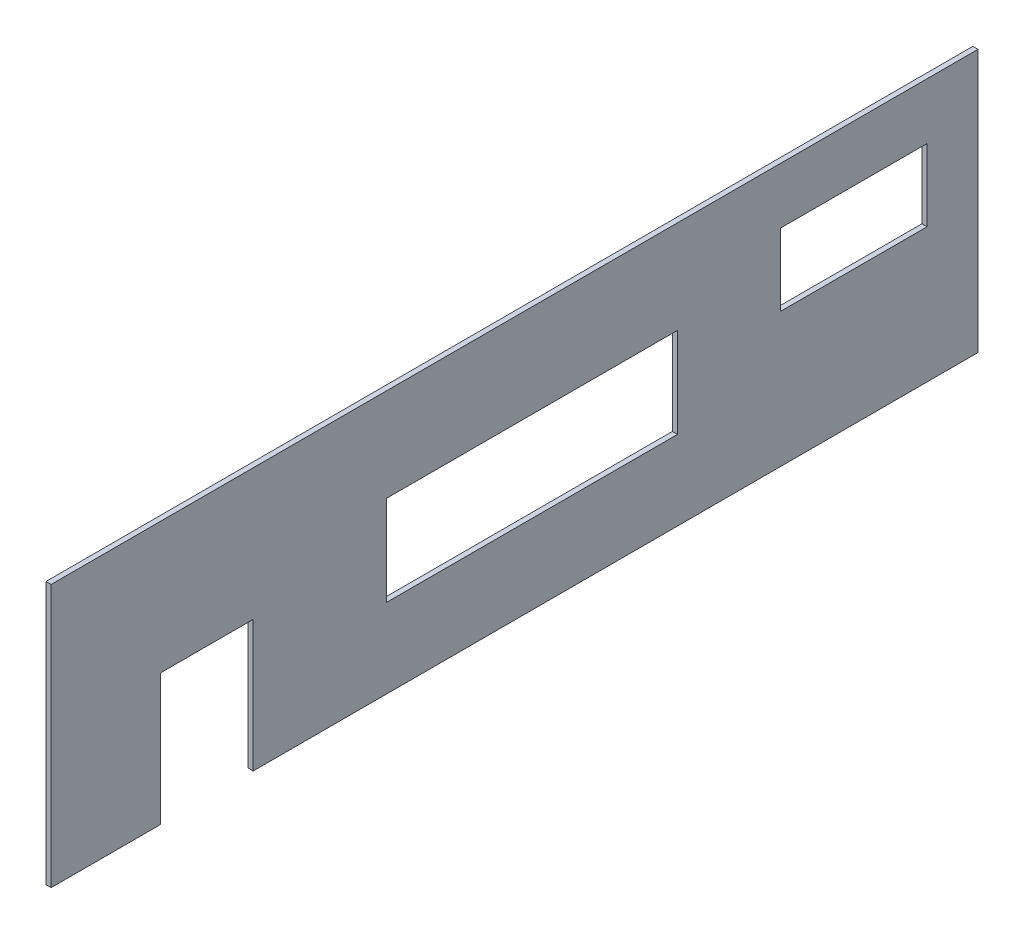
ISO-10303-21;
HEADER;
FILE_DESCRIPTION(('STEP AP214'),'2;1');
FILE_NAME('part.step','',(''),(''),'','','');
FILE_SCHEMA(('AUTOMOTIVE_DESIGN { 1 0 10303 214 1 1 1 1 }'));
ENDSEC;
DATA;
#1=APPLICATION_CONTEXT('core data for automotive mechanical design processes');
#2=APPLICATION_PROTOCOL_DEFINITION('international standard','automotive_design',2000,#1);
#3=PRODUCT_CONTEXT('',#1,'mechanical');
#4=PRODUCT('Part','Part','',(#3));
#5=PRODUCT_RELATED_PRODUCT_CATEGORY('part','',(#4));
#6=PRODUCT_DEFINITION_FORMATION('','',#4);
#7=PRODUCT_DEFINITION_CONTEXT('part definition',#1,'design');
#8=PRODUCT_DEFINITION('design','',#6,#7);
#9=PRODUCT_DEFINITION_SHAPE('','',#8);
#10=(LENGTH_UNIT() NAMED_UNIT(*) SI_UNIT(.MILLI.,.METRE.));
#11=(NAMED_UNIT(*) PLANE_ANGLE_UNIT() SI_UNIT($,.RADIAN.));
#12=(NAMED_UNIT(*) SI_UNIT($,.STERADIAN.) SOLID_ANGLE_UNIT());
#13=UNCERTAINTY_MEASURE_WITH_UNIT(LENGTH_MEASURE(1.E-05),#10,'distance_accuracy_value','');
#14=(GEOMETRIC_REPRESENTATION_CONTEXT(3) GLOBAL_UNCERTAINTY_ASSIGNED_CONTEXT((#13)) GLOBAL_UNIT_ASSIGNED_CONTEXT((#10,
#11,#12)) REPRESENTATION_CONTEXT('',''));
#15=CARTESIAN_POINT('',(0.,0.,0.));
#16=DIRECTION('',(0.,0.,1.));
#17=DIRECTION('',(1.,0.,0.));
#18=AXIS2_PLACEMENT_3D('',#15,#16,#17);
#19=CARTESIAN_POINT('',(2.,19.3043478260869,117.391304347826));
#20=DIRECTION('',(0.,1.,0.));
#21=DIRECTION('',(0.,0.,1.));
#22=AXIS2_PLACEMENT_3D('',#19,#20,#21);
#23=PLANE('',#22);
#24=DIRECTION('',(0.,0.,-1.));
#25=VECTOR('',#24,1.);
#26=CARTESIAN_POINT('',(0.,19.3043478260869,117.391304347826));
#27=LINE('',#26,#25);
#28=CARTESIAN_POINT('',(0.,19.3043478260869,117.391304347826));
#29=VERTEX_POINT('',#28);
#30=CARTESIAN_POINT('',(0.,19.3043478260869,74.9143438257151));
#31=VERTEX_POINT('',#30);
#32=EDGE_CURVE('E250',#29,#31,#27,.T.);
#33=ORIENTED_EDGE('',*,*,#32,.T.);
#34=DIRECTION('',(-1.,0.,0.));
#35=VECTOR('',#34,1.);
#36=CARTESIAN_POINT('',(10.,19.3043478260869,74.9143438257151));
#37=LINE('',#36,#35);
#38=CARTESIAN_POINT('',(2.,19.3043478260869,74.9143438257151));
#39=VERTEX_POINT('',#38);
#40=EDGE_CURVE('E191',#39,#31,#37,.T.);
#41=ORIENTED_EDGE('',*,*,#40,.F.);
#42=DIRECTION('',(0.,0.,-1.));
#43=VECTOR('',#42,1.);
#44=CARTESIAN_POINT('',(2.,19.3043478260869,117.391304347826));
#45=LINE('',#44,#43);
#46=CARTESIAN_POINT('',(2.,19.3043478260869,117.391304347826));
#47=VERTEX_POINT('',#46);
#48=EDGE_CURVE('E239',#47,#39,#45,.T.);
#49=ORIENTED_EDGE('',*,*,#48,.F.);
#50=DIRECTION('',(-1.,0.,0.));
#51=VECTOR('',#50,1.);
#52=CARTESIAN_POINT('',(2.,19.3043478260869,117.391304347826));
#53=LINE('',#52,#51);
#54=EDGE_CURVE('E11',#47,#29,#53,.T.);
#55=ORIENTED_EDGE('',*,*,#54,.T.);
#56=EDGE_LOOP('',(#33,#41,#49,#55));
#57=FACE_BOUND('',#56,.T.);
#58=ADVANCED_FACE('F33',(#57),#23,.F.);
#59=CARTESIAN_POINT('',(2.,121.304347826087,117.391304347826));
#60=DIRECTION('',(0.,0.,-1.));
#61=DIRECTION('',(0.,1.,0.));
#62=AXIS2_PLACEMENT_3D('',#59,#60,#61);
#63=PLANE('',#62);
#64=DIRECTION('',(0.,-1.,0.));
#65=VECTOR('',#64,1.);
#66=CARTESIAN_POINT('',(0.,121.304347826087,117.391304347826));
#67=LINE('',#66,#65);
#68=CARTESIAN_POINT('',(0.,121.304347826087,117.391304347826));
#69=VERTEX_POINT('',#68);
#70=EDGE_CURVE('E233',#69,#29,#67,.T.);
#71=ORIENTED_EDGE('',*,*,#70,.T.);
#72=ORIENTED_EDGE('',*,*,#54,.F.);
#73=DIRECTION('',(0.,-1.,0.));
#74=VECTOR('',#73,1.);
#75=CARTESIAN_POINT('',(2.,121.304347826087,117.391304347826));
#76=LINE('',#75,#74);
#77=CARTESIAN_POINT('',(2.,121.304347826087,117.391304347826));
#78=VERTEX_POINT('',#77);
#79=EDGE_CURVE('E234',#78,#47,#76,.T.);
#80=ORIENTED_EDGE('',*,*,#79,.F.);
#81=DIRECTION('',(-1.,0.,0.));
#82=VECTOR('',#81,1.);
#83=CARTESIAN_POINT('',(2.,121.304347826087,117.391304347826));
#84=LINE('',#83,#82);
#85=EDGE_CURVE('E246',#78,#69,#84,.T.);
#86=ORIENTED_EDGE('',*,*,#85,.T.);
#87=EDGE_LOOP('',(#71,#72,#80,#86));
#88=FACE_BOUND('',#87,.T.);
#89=ADVANCED_FACE('F35',(#88),#63,.F.);
#90=CARTESIAN_POINT('',(2.,19.3043478260869,38.9143438257151));
#91=VERTEX_POINT('',#90);
#92=CARTESIAN_POINT('',(2.,19.3043478260869,-242.608695652174));
#93=VERTEX_POINT('',#92);
#94=EDGE_CURVE('E237',#91,#93,#45,.T.);
#95=ORIENTED_EDGE('',*,*,#94,.F.);
#96=DIRECTION('',(-1.,0.,0.));
#97=VECTOR('',#96,1.);
#98=CARTESIAN_POINT('',(10.,19.3043478260869,38.9143438257151));
#99=LINE('',#98,#97);
#100=CARTESIAN_POINT('',(0.,19.3043478260869,38.9143438257151));
#101=VERTEX_POINT('',#100);
#102=EDGE_CURVE('E194',#91,#101,#99,.T.);
#103=ORIENTED_EDGE('',*,*,#102,.T.);
#104=CARTESIAN_POINT('',(0.,19.3043478260869,-242.608695652174));
#105=VERTEX_POINT('',#104);
#106=EDGE_CURVE('E249',#101,#105,#27,.T.);
#107=ORIENTED_EDGE('',*,*,#106,.T.);
#108=DIRECTION('',(-1.,0.,0.));
#109=VECTOR('',#108,1.);
#110=CARTESIAN_POINT('',(2.,19.3043478260869,-242.608695652174));
#111=LINE('',#110,#109);
#112=EDGE_CURVE('E41',#93,#105,#111,.T.);
#113=ORIENTED_EDGE('',*,*,#112,.F.);
#114=EDGE_LOOP('',(#95,#103,#107,#113));
#115=FACE_BOUND('',#114,.T.);
#116=ADVANCED_FACE('F288',(#115),#23,.F.);
#117=CARTESIAN_POINT('',(2.,121.304347826087,-242.608695652174));
#118=DIRECTION('',(0.,0.,1.));
#119=DIRECTION('',(0.,-1.,0.));
#120=AXIS2_PLACEMENT_3D('',#117,#118,#119);
#121=PLANE('',#120);
#122=DIRECTION('',(0.,1.,0.));
#123=VECTOR('',#122,1.);
#124=CARTESIAN_POINT('',(0.,121.304347826087,-242.608695652174));
#125=LINE('',#124,#123);
#126=CARTESIAN_POINT('',(0.,121.304347826087,-242.608695652174));
#127=VERTEX_POINT('',#126);
#128=EDGE_CURVE('E253',#105,#127,#125,.T.);
#129=ORIENTED_EDGE('',*,*,#128,.T.);
#130=DIRECTION('',(-1.,0.,0.));
#131=VECTOR('',#130,1.);
#132=CARTESIAN_POINT('',(2.,121.304347826087,-242.608695652174));
#133=LINE('',#132,#131);
#134=CARTESIAN_POINT('',(2.,121.304347826087,-242.608695652174));
#135=VERTEX_POINT('',#134);
#136=EDGE_CURVE('E258',#135,#127,#133,.T.);
#137=ORIENTED_EDGE('',*,*,#136,.F.);
#138=DIRECTION('',(0.,1.,0.));
#139=VECTOR('',#138,1.);
#140=CARTESIAN_POINT('',(2.,121.304347826087,-242.608695652174));
#141=LINE('',#140,#139);
#142=EDGE_CURVE('E242',#93,#135,#141,.T.);
#143=ORIENTED_EDGE('',*,*,#142,.F.);
#144=ORIENTED_EDGE('',*,*,#112,.T.);
#145=EDGE_LOOP('',(#129,#137,#143,#144));
#146=FACE_BOUND('',#145,.T.);
#147=ADVANCED_FACE('F265',(#146),#121,.F.);
#148=CARTESIAN_POINT('',(2.,121.304347826087,117.391304347826));
#149=DIRECTION('',(0.,-1.,0.));
#150=DIRECTION('',(0.,0.,-1.));
#151=AXIS2_PLACEMENT_3D('',#148,#149,#150);
#152=PLANE('',#151);
#153=DIRECTION('',(0.,0.,1.));
#154=VECTOR('',#153,1.);
#155=CARTESIAN_POINT('',(0.,121.304347826087,117.391304347826));
#156=LINE('',#155,#154);
#157=EDGE_CURVE('E238',#127,#69,#156,.T.);
#158=ORIENTED_EDGE('',*,*,#157,.T.);
#159=ORIENTED_EDGE('',*,*,#85,.F.);
#160=DIRECTION('',(0.,0.,1.));
#161=VECTOR('',#160,1.);
#162=CARTESIAN_POINT('',(2.,121.304347826087,117.391304347826));
#163=LINE('',#162,#161);
#164=EDGE_CURVE('E244',#135,#78,#163,.T.);
#165=ORIENTED_EDGE('',*,*,#164,.F.);
#166=ORIENTED_EDGE('',*,*,#136,.T.);
#167=EDGE_LOOP('',(#158,#159,#165,#166));
#168=FACE_BOUND('',#167,.T.);
#169=ADVANCED_FACE('F277',(#168),#152,.F.);
#170=CARTESIAN_POINT('',(2.,0.,0.));
#171=DIRECTION('',(1.,0.,0.));
#172=DIRECTION('',(0.,0.,-1.));
#173=AXIS2_PLACEMENT_3D('',#170,#171,#172);
#174=PLANE('',#173);
#175=DIRECTION('',(0.,1.,0.));
#176=VECTOR('',#175,1.);
#177=CARTESIAN_POINT('',(2.,0.,-222.833824882395));
#178=LINE('',#177,#176);
#179=CARTESIAN_POINT('',(2.,71.5107775658255,-222.833824882395));
#180=VERTEX_POINT('',#179);
#181=CARTESIAN_POINT('',(2.,99.5107775658255,-222.833824882395));
#182=VERTEX_POINT('',#181);
#183=EDGE_CURVE('E179',#180,#182,#178,.T.);
#184=ORIENTED_EDGE('',*,*,#183,.F.);
#185=DIRECTION('',(0.,0.,-1.));
#186=VECTOR('',#185,1.);
#187=CARTESIAN_POINT('',(2.,71.5107775658255,0.));
#188=LINE('',#187,#186);
#189=CARTESIAN_POINT('',(2.,71.5107775658255,-165.833824882395));
#190=VERTEX_POINT('',#189);
#191=EDGE_CURVE('E172',#190,#180,#188,.T.);
#192=ORIENTED_EDGE('',*,*,#191,.F.);
#193=DIRECTION('',(0.,-1.,0.));
#194=VECTOR('',#193,1.);
#195=CARTESIAN_POINT('',(2.,0.,-165.833824882395));
#196=LINE('',#195,#194);
#197=CARTESIAN_POINT('',(2.,99.5107775658255,-165.833824882395));
#198=VERTEX_POINT('',#197);
#199=EDGE_CURVE('E152',#198,#190,#196,.T.);
#200=ORIENTED_EDGE('',*,*,#199,.F.);
#201=DIRECTION('',(0.,0.,1.));
#202=VECTOR('',#201,1.);
#203=CARTESIAN_POINT('',(2.,99.5107775658255,0.));
#204=LINE('',#203,#202);
#205=EDGE_CURVE('E177',#182,#198,#204,.T.);
#206=ORIENTED_EDGE('',*,*,#205,.F.);
#207=EDGE_LOOP('',(#184,#192,#200,#206));
#208=FACE_BOUND('',#207,.T.);
#209=DIRECTION('',(0.,-1.,0.));
#210=VECTOR('',#209,1.);
#211=CARTESIAN_POINT('',(2.,0.,74.9143438257151));
#212=LINE('',#211,#210);
#213=CARTESIAN_POINT('',(2.,70.3043478260869,74.9143438257151));
#214=VERTEX_POINT('',#213);
#215=EDGE_CURVE('E231',#214,#39,#212,.T.);
#216=ORIENTED_EDGE('',*,*,#215,.F.);
#217=DIRECTION('',(0.,0.,1.));
#218=VECTOR('',#217,1.);
#219=CARTESIAN_POINT('',(2.,70.3043478260869,0.));
#220=LINE('',#219,#218);
#221=CARTESIAN_POINT('',(2.,70.3043478260869,38.9143438257151));
#222=VERTEX_POINT('',#221);
#223=EDGE_CURVE('E227',#222,#214,#220,.T.);
#224=ORIENTED_EDGE('',*,*,#223,.F.);
#225=DIRECTION('',(0.,1.,0.));
#226=VECTOR('',#225,1.);
#227=CARTESIAN_POINT('',(2.,0.,38.9143438257151));
#228=LINE('',#227,#226);
#229=EDGE_CURVE('E229',#91,#222,#228,.T.);
#230=ORIENTED_EDGE('',*,*,#229,.F.);
#231=ORIENTED_EDGE('',*,*,#94,.T.);
#232=ORIENTED_EDGE('',*,*,#142,.T.);
#233=ORIENTED_EDGE('',*,*,#164,.T.);
#234=ORIENTED_EDGE('',*,*,#79,.T.);
#235=ORIENTED_EDGE('',*,*,#48,.T.);
#236=EDGE_LOOP('',(#216,#224,#230,#231,#232,#233,#234,#235));
#237=FACE_BOUND('',#236,.T.);
#238=DIRECTION('',(0.,1.,0.));
#239=VECTOR('',#238,1.);
#240=CARTESIAN_POINT('',(2.,0.,-125.866260537104));
#241=LINE('',#240,#239);
#242=CARTESIAN_POINT('',(2.,50.1308071854282,-125.866260537104));
#243=VERTEX_POINT('',#242);
#244=CARTESIAN_POINT('',(2.,85.1308071854282,-125.866260537104));
#245=VERTEX_POINT('',#244);
#246=EDGE_CURVE('E225',#243,#245,#241,.T.);
#247=ORIENTED_EDGE('',*,*,#246,.F.);
#248=DIRECTION('',(0.,0.,-1.));
#249=VECTOR('',#248,1.);
#250=CARTESIAN_POINT('',(2.,50.1308071854282,0.));
#251=LINE('',#250,#249);
#252=CARTESIAN_POINT('',(2.,50.1308071854282,-12.8662605371042));
#253=VERTEX_POINT('',#252);
#254=EDGE_CURVE('E193',#253,#243,#251,.T.);
#255=ORIENTED_EDGE('',*,*,#254,.F.);
#256=DIRECTION('',(0.,-1.,0.));
#257=VECTOR('',#256,1.);
#258=CARTESIAN_POINT('',(2.,0.,-12.8662605371042));
#259=LINE('',#258,#257);
#260=CARTESIAN_POINT('',(2.,85.1308071854282,-12.8662605371042));
#261=VERTEX_POINT('',#260);
#262=EDGE_CURVE('E220',#261,#253,#259,.T.);
#263=ORIENTED_EDGE('',*,*,#262,.F.);
#264=DIRECTION('',(0.,0.,1.));
#265=VECTOR('',#264,1.);
#266=CARTESIAN_POINT('',(2.,85.1308071854282,0.));
#267=LINE('',#266,#265);
#268=EDGE_CURVE('E223',#245,#261,#267,.T.);
#269=ORIENTED_EDGE('',*,*,#268,.F.);
#270=EDGE_LOOP('',(#247,#255,#263,#269));
#271=FACE_BOUND('',#270,.T.);
#272=ADVANCED_FACE('F284',(#208,#237,#271),#174,.T.);
#273=CARTESIAN_POINT('',(0.,0.,0.));
#274=DIRECTION('',(1.,0.,0.));
#275=DIRECTION('',(0.,0.,-1.));
#276=AXIS2_PLACEMENT_3D('',#273,#274,#275);
#277=PLANE('',#276);
#278=DIRECTION('',(0.,0.,1.));
#279=VECTOR('',#278,1.);
#280=CARTESIAN_POINT('',(0.,71.5107775658255,-222.833824882395));
#281=LINE('',#280,#279);
#282=CARTESIAN_POINT('',(0.,71.5107775658255,-222.833824882395));
#283=VERTEX_POINT('',#282);
#284=CARTESIAN_POINT('',(0.,71.5107775658255,-165.833824882395));
#285=VERTEX_POINT('',#284);
#286=EDGE_CURVE('E158',#283,#285,#281,.T.);
#287=ORIENTED_EDGE('',*,*,#286,.F.);
#288=DIRECTION('',(0.,-1.,0.));
#289=VECTOR('',#288,1.);
#290=CARTESIAN_POINT('',(0.,99.5107775658255,-222.833824882395));
#291=LINE('',#290,#289);
#292=CARTESIAN_POINT('',(0.,99.5107775658255,-222.833824882395));
#293=VERTEX_POINT('',#292);
#294=EDGE_CURVE('E56',#293,#283,#291,.T.);
#295=ORIENTED_EDGE('',*,*,#294,.F.);
#296=DIRECTION('',(0.,0.,-1.));
#297=VECTOR('',#296,1.);
#298=CARTESIAN_POINT('',(0.,99.5107775658255,-222.833824882395));
#299=LINE('',#298,#297);
#300=CARTESIAN_POINT('',(0.,99.5107775658255,-165.833824882395));
#301=VERTEX_POINT('',#300);
#302=EDGE_CURVE('E165',#301,#293,#299,.T.);
#303=ORIENTED_EDGE('',*,*,#302,.F.);
#304=DIRECTION('',(0.,1.,0.));
#305=VECTOR('',#304,1.);
#306=CARTESIAN_POINT('',(0.,99.5107775658255,-165.833824882395));
#307=LINE('',#306,#305);
#308=EDGE_CURVE('E149',#285,#301,#307,.T.);
#309=ORIENTED_EDGE('',*,*,#308,.F.);
#310=EDGE_LOOP('',(#287,#295,#303,#309));
#311=FACE_BOUND('',#310,.T.);
#312=DIRECTION('',(0.,0.,1.));
#313=VECTOR('',#312,1.);
#314=CARTESIAN_POINT('',(0.,50.1308071854282,-125.866260537104));
#315=LINE('',#314,#313);
#316=CARTESIAN_POINT('',(0.,50.1308071854282,-125.866260537104));
#317=VERTEX_POINT('',#316);
#318=CARTESIAN_POINT('',(0.,50.1308071854282,-12.8662605371042));
#319=VERTEX_POINT('',#318);
#320=EDGE_CURVE('E202',#317,#319,#315,.T.);
#321=ORIENTED_EDGE('',*,*,#320,.F.);
#322=DIRECTION('',(0.,-1.,0.));
#323=VECTOR('',#322,1.);
#324=CARTESIAN_POINT('',(0.,85.1308071854282,-125.866260537104));
#325=LINE('',#324,#323);
#326=CARTESIAN_POINT('',(0.,85.1308071854282,-125.866260537104));
#327=VERTEX_POINT('',#326);
#328=EDGE_CURVE('E181',#327,#317,#325,.T.);
#329=ORIENTED_EDGE('',*,*,#328,.F.);
#330=DIRECTION('',(0.,0.,-1.));
#331=VECTOR('',#330,1.);
#332=CARTESIAN_POINT('',(0.,85.1308071854282,-125.866260537104));
#333=LINE('',#332,#331);
#334=CARTESIAN_POINT('',(0.,85.1308071854282,-12.8662605371042));
#335=VERTEX_POINT('',#334);
#336=EDGE_CURVE('E208',#335,#327,#333,.T.);
#337=ORIENTED_EDGE('',*,*,#336,.F.);
#338=DIRECTION('',(0.,1.,0.));
#339=VECTOR('',#338,1.);
#340=CARTESIAN_POINT('',(0.,85.1308071854282,-12.8662605371042));
#341=LINE('',#340,#339);
#342=EDGE_CURVE('E205',#319,#335,#341,.T.);
#343=ORIENTED_EDGE('',*,*,#342,.F.);
#344=EDGE_LOOP('',(#321,#329,#337,#343));
#345=FACE_BOUND('',#344,.T.);
#346=DIRECTION('',(0.,0.,-1.));
#347=VECTOR('',#346,1.);
#348=CARTESIAN_POINT('',(0.,70.3043478260869,74.9143438257151));
#349=LINE('',#348,#347);
#350=CARTESIAN_POINT('',(0.,70.3043478260869,74.9143438257151));
#351=VERTEX_POINT('',#350);
#352=CARTESIAN_POINT('',(0.,70.3043478260869,38.9143438257151));
#353=VERTEX_POINT('',#352);
#354=EDGE_CURVE('E184',#351,#353,#349,.T.);
#355=ORIENTED_EDGE('',*,*,#354,.F.);
#356=DIRECTION('',(0.,1.,0.));
#357=VECTOR('',#356,1.);
#358=CARTESIAN_POINT('',(0.,19.3043478260869,74.9143438257151));
#359=LINE('',#358,#357);
#360=EDGE_CURVE('E182',#31,#351,#359,.T.);
#361=ORIENTED_EDGE('',*,*,#360,.F.);
#362=ORIENTED_EDGE('',*,*,#32,.F.);
#363=ORIENTED_EDGE('',*,*,#70,.F.);
#364=ORIENTED_EDGE('',*,*,#157,.F.);
#365=ORIENTED_EDGE('',*,*,#128,.F.);
#366=ORIENTED_EDGE('',*,*,#106,.F.);
#367=DIRECTION('',(0.,-1.,0.));
#368=VECTOR('',#367,1.);
#369=CARTESIAN_POINT('',(0.,19.3043478260869,38.9143438257151));
#370=LINE('',#369,#368);
#371=EDGE_CURVE('E188',#353,#101,#370,.T.);
#372=ORIENTED_EDGE('',*,*,#371,.F.);
#373=EDGE_LOOP('',(#355,#361,#362,#363,#364,#365,#366,#372));
#374=FACE_BOUND('',#373,.T.);
#375=ADVANCED_FACE('F162',(#311,#345,#374),#277,.F.);
#376=CARTESIAN_POINT('',(10.,85.1308071854282,-125.866260537104));
#377=DIRECTION('',(0.,0.,-1.));
#378=DIRECTION('',(-1.,0.,0.));
#379=AXIS2_PLACEMENT_3D('',#376,#377,#378);
#380=PLANE('',#379);
#381=ORIENTED_EDGE('',*,*,#246,.T.);
#382=DIRECTION('',(-1.,0.,0.));
#383=VECTOR('',#382,1.);
#384=CARTESIAN_POINT('',(10.,85.1308071854282,-125.866260537104));
#385=LINE('',#384,#383);
#386=EDGE_CURVE('E185',#245,#327,#385,.T.);
#387=ORIENTED_EDGE('',*,*,#386,.T.);
#388=ORIENTED_EDGE('',*,*,#328,.T.);
#389=DIRECTION('',(-1.,0.,0.));
#390=VECTOR('',#389,1.);
#391=CARTESIAN_POINT('',(10.,50.1308071854282,-125.866260537104));
#392=LINE('',#391,#390);
#393=EDGE_CURVE('E211',#243,#317,#392,.T.);
#394=ORIENTED_EDGE('',*,*,#393,.F.);
#395=EDGE_LOOP('',(#381,#387,#388,#394));
#396=FACE_BOUND('',#395,.T.);
#397=ADVANCED_FACE('F316',(#396),#380,.F.);
#398=CARTESIAN_POINT('',(10.,85.1308071854282,-125.866260537104));
#399=DIRECTION('',(0.,1.,0.));
#400=DIRECTION('',(0.,0.,1.));
#401=AXIS2_PLACEMENT_3D('',#398,#399,#400);
#402=PLANE('',#401);
#403=ORIENTED_EDGE('',*,*,#268,.T.);
#404=DIRECTION('',(-1.,0.,0.));
#405=VECTOR('',#404,1.);
#406=CARTESIAN_POINT('',(10.,85.1308071854282,-12.8662605371042));
#407=LINE('',#406,#405);
#408=EDGE_CURVE('E213',#261,#335,#407,.T.);
#409=ORIENTED_EDGE('',*,*,#408,.T.);
#410=ORIENTED_EDGE('',*,*,#336,.T.);
#411=ORIENTED_EDGE('',*,*,#386,.F.);
#412=EDGE_LOOP('',(#403,#409,#410,#411));
#413=FACE_BOUND('',#412,.T.);
#414=ADVANCED_FACE('F322',(#413),#402,.F.);
#415=CARTESIAN_POINT('',(10.,85.1308071854282,-12.8662605371042));
#416=DIRECTION('',(0.,0.,1.));
#417=DIRECTION('',(1.,0.,0.));
#418=AXIS2_PLACEMENT_3D('',#415,#416,#417);
#419=PLANE('',#418);
#420=ORIENTED_EDGE('',*,*,#262,.T.);
#421=DIRECTION('',(-1.,0.,0.));
#422=VECTOR('',#421,1.);
#423=CARTESIAN_POINT('',(10.,50.1308071854282,-12.8662605371042));
#424=LINE('',#423,#422);
#425=EDGE_CURVE('E215',#253,#319,#424,.T.);
#426=ORIENTED_EDGE('',*,*,#425,.T.);
#427=ORIENTED_EDGE('',*,*,#342,.T.);
#428=ORIENTED_EDGE('',*,*,#408,.F.);
#429=EDGE_LOOP('',(#420,#426,#427,#428));
#430=FACE_BOUND('',#429,.T.);
#431=ADVANCED_FACE('F327',(#430),#419,.F.);
#432=CARTESIAN_POINT('',(10.,50.1308071854282,-125.866260537104));
#433=DIRECTION('',(0.,-1.,0.));
#434=DIRECTION('',(0.,0.,-1.));
#435=AXIS2_PLACEMENT_3D('',#432,#433,#434);
#436=PLANE('',#435);
#437=ORIENTED_EDGE('',*,*,#254,.T.);
#438=ORIENTED_EDGE('',*,*,#393,.T.);
#439=ORIENTED_EDGE('',*,*,#320,.T.);
#440=ORIENTED_EDGE('',*,*,#425,.F.);
#441=EDGE_LOOP('',(#437,#438,#439,#440));
#442=FACE_BOUND('',#441,.T.);
#443=ADVANCED_FACE('F324',(#442),#436,.F.);
#444=CARTESIAN_POINT('',(10.,19.3043478260869,74.9143438257151));
#445=DIRECTION('',(0.,0.,1.));
#446=DIRECTION('',(1.,0.,0.));
#447=AXIS2_PLACEMENT_3D('',#444,#445,#446);
#448=PLANE('',#447);
#449=ORIENTED_EDGE('',*,*,#215,.T.);
#450=ORIENTED_EDGE('',*,*,#40,.T.);
#451=ORIENTED_EDGE('',*,*,#360,.T.);
#452=DIRECTION('',(-1.,0.,0.));
#453=VECTOR('',#452,1.);
#454=CARTESIAN_POINT('',(10.,70.3043478260869,74.9143438257151));
#455=LINE('',#454,#453);
#456=EDGE_CURVE('E190',#214,#351,#455,.T.);
#457=ORIENTED_EDGE('',*,*,#456,.F.);
#458=EDGE_LOOP('',(#449,#450,#451,#457));
#459=FACE_BOUND('',#458,.T.);
#460=ADVANCED_FACE('F297',(#459),#448,.F.);
#461=CARTESIAN_POINT('',(10.,19.3043478260869,38.9143438257151));
#462=DIRECTION('',(0.,0.,-1.));
#463=DIRECTION('',(0.,1.,0.));
#464=AXIS2_PLACEMENT_3D('',#461,#462,#463);
#465=PLANE('',#464);
#466=ORIENTED_EDGE('',*,*,#229,.T.);
#467=DIRECTION('',(-1.,0.,0.));
#468=VECTOR('',#467,1.);
#469=CARTESIAN_POINT('',(10.,70.3043478260869,38.9143438257151));
#470=LINE('',#469,#468);
#471=EDGE_CURVE('E197',#222,#353,#470,.T.);
#472=ORIENTED_EDGE('',*,*,#471,.T.);
#473=ORIENTED_EDGE('',*,*,#371,.T.);
#474=ORIENTED_EDGE('',*,*,#102,.F.);
#475=EDGE_LOOP('',(#466,#472,#473,#474));
#476=FACE_BOUND('',#475,.T.);
#477=ADVANCED_FACE('F290',(#476),#465,.F.);
#478=CARTESIAN_POINT('',(10.,70.3043478260869,74.9143438257151));
#479=DIRECTION('',(0.,1.,0.));
#480=DIRECTION('',(0.,0.,1.));
#481=AXIS2_PLACEMENT_3D('',#478,#479,#480);
#482=PLANE('',#481);
#483=ORIENTED_EDGE('',*,*,#223,.T.);
#484=ORIENTED_EDGE('',*,*,#456,.T.);
#485=ORIENTED_EDGE('',*,*,#354,.T.);
#486=ORIENTED_EDGE('',*,*,#471,.F.);
#487=EDGE_LOOP('',(#483,#484,#485,#486));
#488=FACE_BOUND('',#487,.T.);
#489=ADVANCED_FACE('F294',(#488),#482,.F.);
#490=CARTESIAN_POINT('',(10.,99.5107775658255,-222.833824882395));
#491=DIRECTION('',(0.,0.,-1.));
#492=DIRECTION('',(-1.,0.,0.));
#493=AXIS2_PLACEMENT_3D('',#490,#491,#492);
#494=PLANE('',#493);
#495=ORIENTED_EDGE('',*,*,#183,.T.);
#496=DIRECTION('',(-1.,0.,0.));
#497=VECTOR('',#496,1.);
#498=CARTESIAN_POINT('',(10.,99.5107775658255,-222.833824882395));
#499=LINE('',#498,#497);
#500=EDGE_CURVE('E170',#182,#293,#499,.T.);
#501=ORIENTED_EDGE('',*,*,#500,.T.);
#502=ORIENTED_EDGE('',*,*,#294,.T.);
#503=DIRECTION('',(-1.,0.,0.));
#504=VECTOR('',#503,1.);
#505=CARTESIAN_POINT('',(10.,71.5107775658255,-222.833824882395));
#506=LINE('',#505,#504);
#507=EDGE_CURVE('E155',#180,#283,#506,.T.);
#508=ORIENTED_EDGE('',*,*,#507,.F.);
#509=EDGE_LOOP('',(#495,#501,#502,#508));
#510=FACE_BOUND('',#509,.T.);
#511=ADVANCED_FACE('F339',(#510),#494,.F.);
#512=CARTESIAN_POINT('',(10.,99.5107775658255,-222.833824882395));
#513=DIRECTION('',(0.,1.,0.));
#514=DIRECTION('',(0.,0.,1.));
#515=AXIS2_PLACEMENT_3D('',#512,#513,#514);
#516=PLANE('',#515);
#517=ORIENTED_EDGE('',*,*,#205,.T.);
#518=DIRECTION('',(-1.,0.,0.));
#519=VECTOR('',#518,1.);
#520=CARTESIAN_POINT('',(10.,99.5107775658255,-165.833824882395));
#521=LINE('',#520,#519);
#522=EDGE_CURVE('E154',#198,#301,#521,.T.);
#523=ORIENTED_EDGE('',*,*,#522,.T.);
#524=ORIENTED_EDGE('',*,*,#302,.T.);
#525=ORIENTED_EDGE('',*,*,#500,.F.);
#526=EDGE_LOOP('',(#517,#523,#524,#525));
#527=FACE_BOUND('',#526,.T.);
#528=ADVANCED_FACE('F344',(#527),#516,.F.);
#529=CARTESIAN_POINT('',(10.,99.5107775658255,-165.833824882395));
#530=DIRECTION('',(0.,0.,1.));
#531=DIRECTION('',(1.,0.,0.));
#532=AXIS2_PLACEMENT_3D('',#529,#530,#531);
#533=PLANE('',#532);
#534=ORIENTED_EDGE('',*,*,#199,.T.);
#535=DIRECTION('',(-1.,0.,0.));
#536=VECTOR('',#535,1.);
#537=CARTESIAN_POINT('',(10.,71.5107775658255,-165.833824882395));
#538=LINE('',#537,#536);
#539=EDGE_CURVE('E48',#190,#285,#538,.T.);
#540=ORIENTED_EDGE('',*,*,#539,.T.);
#541=ORIENTED_EDGE('',*,*,#308,.T.);
#542=ORIENTED_EDGE('',*,*,#522,.F.);
#543=EDGE_LOOP('',(#534,#540,#541,#542));
#544=FACE_BOUND('',#543,.T.);
#545=ADVANCED_FACE('F146',(#544),#533,.F.);
#546=CARTESIAN_POINT('',(10.,71.5107775658255,-222.833824882395));
#547=DIRECTION('',(0.,-1.,0.));
#548=DIRECTION('',(0.,0.,-1.));
#549=AXIS2_PLACEMENT_3D('',#546,#547,#548);
#550=PLANE('',#549);
#551=ORIENTED_EDGE('',*,*,#191,.T.);
#552=ORIENTED_EDGE('',*,*,#507,.T.);
#553=ORIENTED_EDGE('',*,*,#286,.T.);
#554=ORIENTED_EDGE('',*,*,#539,.F.);
#555=EDGE_LOOP('',(#551,#552,#553,#554));
#556=FACE_BOUND('',#555,.T.);
#557=ADVANCED_FACE('F159',(#556),#550,.F.);
#558=CLOSED_SHELL('',(#58,#89,#116,#147,#169,#272,#375,#397,#414,#431,#443,#460,#477,#489,#511,
#528,#545,#557));
#559=MANIFOLD_SOLID_BREP('B2',#558);
#560=ADVANCED_BREP_SHAPE_REPRESENTATION('',(#18,#559),#14);
#561=SHAPE_DEFINITION_REPRESENTATION(#9,#560);
ENDSEC;
END-ISO-10303-21;
